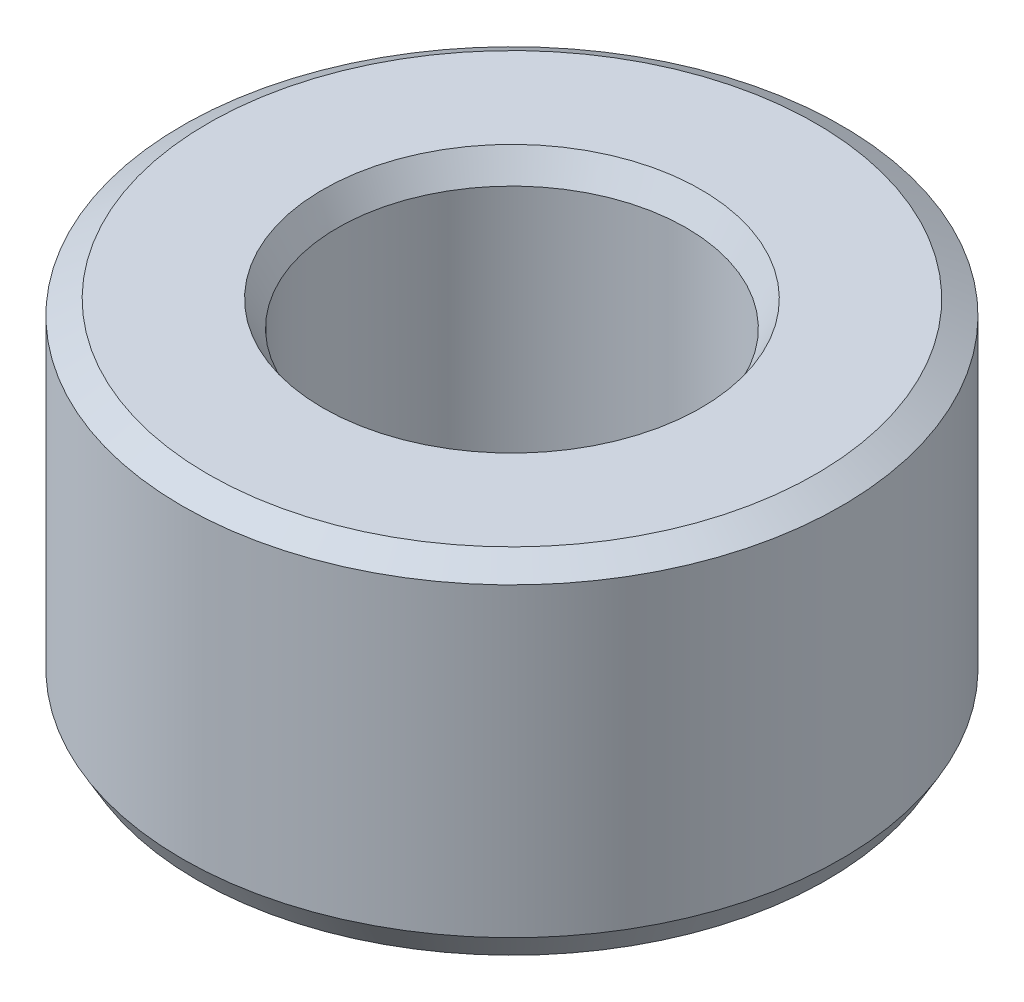
ISO-10303-21;
HEADER;
FILE_DESCRIPTION(('STEP AP214'),'2;1');
FILE_NAME('part.step','',(''),(''),'','','');
FILE_SCHEMA(('AUTOMOTIVE_DESIGN { 1 0 10303 214 1 1 1 1 }'));
ENDSEC;
DATA;
#1=APPLICATION_CONTEXT('core data for automotive mechanical design processes');
#2=APPLICATION_PROTOCOL_DEFINITION('international standard','automotive_design',2000,#1);
#3=PRODUCT_CONTEXT('',#1,'mechanical');
#4=PRODUCT('Part','Part','',(#3));
#5=PRODUCT_RELATED_PRODUCT_CATEGORY('part','',(#4));
#6=PRODUCT_DEFINITION_FORMATION('','',#4);
#7=PRODUCT_DEFINITION_CONTEXT('part definition',#1,'design');
#8=PRODUCT_DEFINITION('design','',#6,#7);
#9=PRODUCT_DEFINITION_SHAPE('','',#8);
#10=(LENGTH_UNIT() NAMED_UNIT(*) SI_UNIT(.MILLI.,.METRE.));
#11=(NAMED_UNIT(*) PLANE_ANGLE_UNIT() SI_UNIT($,.RADIAN.));
#12=(NAMED_UNIT(*) SI_UNIT($,.STERADIAN.) SOLID_ANGLE_UNIT());
#13=UNCERTAINTY_MEASURE_WITH_UNIT(LENGTH_MEASURE(1.E-05),#10,'distance_accuracy_value','');
#14=(GEOMETRIC_REPRESENTATION_CONTEXT(3) GLOBAL_UNCERTAINTY_ASSIGNED_CONTEXT((#13)) GLOBAL_UNIT_ASSIGNED_CONTEXT((#10,
#11,#12)) REPRESENTATION_CONTEXT('',''));
#15=CARTESIAN_POINT('',(0.,0.,0.));
#16=DIRECTION('',(0.,0.,1.));
#17=DIRECTION('',(1.,0.,0.));
#18=AXIS2_PLACEMENT_3D('',#15,#16,#17);
#19=CARTESIAN_POINT('',(0.,44.6187558369004,0.));
#20=DIRECTION('',(0.,-1.,0.));
#21=DIRECTION('',(0.,0.,-1.));
#22=AXIS2_PLACEMENT_3D('',#19,#20,#21);
#23=CYLINDRICAL_SURFACE('',#22,42.5);
#24=CARTESIAN_POINT('',(0.,3.3073891955385,0.));
#25=DIRECTION('',(0.,1.,0.));
#26=DIRECTION('',(0.,0.,1.));
#27=AXIS2_PLACEMENT_3D('',#24,#25,#26);
#28=CIRCLE('',#27,42.5);
#29=CARTESIAN_POINT('',(0.,3.3073891955385,42.5));
#30=VERTEX_POINT('',#29);
#31=EDGE_CURVE('E10',#30,#30,#28,.T.);
#32=ORIENTED_EDGE('',*,*,#31,.T.);
#33=EDGE_LOOP('',(#32));
#34=FACE_BOUND('',#33,.T.);
#35=CARTESIAN_POINT('',(0.,42.7092337945414,0.));
#36=DIRECTION('',(0.,1.,0.));
#37=DIRECTION('',(0.,0.,1.));
#38=AXIS2_PLACEMENT_3D('',#35,#36,#37);
#39=CIRCLE('',#38,42.5);
#40=CARTESIAN_POINT('',(0.,42.7092337945414,42.5));
#41=VERTEX_POINT('',#40);
#42=EDGE_CURVE('E50',#41,#41,#39,.F.);
#43=ORIENTED_EDGE('',*,*,#42,.T.);
#44=EDGE_LOOP('',(#43));
#45=FACE_BOUND('',#44,.T.);
#46=ADVANCED_FACE('F39',(#34,#45),#23,.T.);
#47=CARTESIAN_POINT('',(0.,44.6187558369004,0.));
#48=DIRECTION('',(0.,1.,0.));
#49=DIRECTION('',(0.,0.,1.));
#50=AXIS2_PLACEMENT_3D('',#47,#48,#49);
#51=PLANE('',#50);
#52=CARTESIAN_POINT('',(0.,44.6187558369004,0.));
#53=DIRECTION('',(0.,1.,0.));
#54=DIRECTION('',(0.,0.,1.));
#55=AXIS2_PLACEMENT_3D('',#52,#53,#54);
#56=CIRCLE('',#55,24.3830783270782);
#57=CARTESIAN_POINT('',(0.,44.6187558369004,24.3830783270782));
#58=VERTEX_POINT('',#57);
#59=EDGE_CURVE('E58',#58,#58,#56,.F.);
#60=ORIENTED_EDGE('',*,*,#59,.T.);
#61=EDGE_LOOP('',(#60));
#62=FACE_BOUND('',#61,.T.);
#63=CARTESIAN_POINT('',(0.,44.6187558369004,0.));
#64=DIRECTION('',(0.,1.,0.));
#65=DIRECTION('',(0.,0.,1.));
#66=AXIS2_PLACEMENT_3D('',#63,#64,#65);
#67=CIRCLE('',#66,39.1926108044615);
#68=CARTESIAN_POINT('',(0.,44.6187558369004,39.1926108044615));
#69=VERTEX_POINT('',#68);
#70=EDGE_CURVE('E61',#69,#69,#67,.T.);
#71=ORIENTED_EDGE('',*,*,#70,.T.);
#72=EDGE_LOOP('',(#71));
#73=FACE_BOUND('',#72,.T.);
#74=ADVANCED_FACE('F88',(#62,#73),#51,.T.);
#75=CARTESIAN_POINT('',(0.,0.,0.));
#76=DIRECTION('',(0.,1.,0.));
#77=DIRECTION('',(0.,0.,1.));
#78=AXIS2_PLACEMENT_3D('',#75,#76,#77);
#79=PLANE('',#78);
#80=CARTESIAN_POINT('',(0.,0.,0.));
#81=DIRECTION('',(0.,1.,0.));
#82=DIRECTION('',(0.,0.,1.));
#83=AXIS2_PLACEMENT_3D('',#80,#81,#82);
#84=CIRCLE('',#83,25.7809454802577);
#85=CARTESIAN_POINT('',(0.,0.,25.7809454802577));
#86=VERTEX_POINT('',#85);
#87=EDGE_CURVE('E51',#86,#86,#84,.T.);
#88=ORIENTED_EDGE('',*,*,#87,.T.);
#89=EDGE_LOOP('',(#88));
#90=FACE_BOUND('',#89,.T.);
#91=CARTESIAN_POINT('',(0.,0.,0.));
#92=DIRECTION('',(0.,1.,0.));
#93=DIRECTION('',(0.,0.,1.));
#94=AXIS2_PLACEMENT_3D('',#91,#92,#93);
#95=CIRCLE('',#94,40.590477957641);
#96=CARTESIAN_POINT('',(0.,0.,40.590477957641));
#97=VERTEX_POINT('',#96);
#98=EDGE_CURVE('E54',#97,#97,#95,.F.);
#99=ORIENTED_EDGE('',*,*,#98,.T.);
#100=EDGE_LOOP('',(#99));
#101=FACE_BOUND('',#100,.T.);
#102=ADVANCED_FACE('F83',(#90,#101),#79,.F.);
#103=CARTESIAN_POINT('',(0.,44.6187558369004,0.));
#104=DIRECTION('',(0.,-1.,0.));
#105=DIRECTION('',(0.,0.,-1.));
#106=AXIS2_PLACEMENT_3D('',#103,#104,#105);
#107=CYLINDRICAL_SURFACE('',#106,22.4735562847192);
#108=CARTESIAN_POINT('',(0.,41.3113666413619,0.));
#109=DIRECTION('',(0.,1.,0.));
#110=DIRECTION('',(0.,0.,1.));
#111=AXIS2_PLACEMENT_3D('',#108,#109,#110);
#112=CIRCLE('',#111,22.4735562847192);
#113=CARTESIAN_POINT('',(0.,41.3113666413619,22.4735562847192));
#114=VERTEX_POINT('',#113);
#115=EDGE_CURVE('E67',#114,#114,#112,.T.);
#116=ORIENTED_EDGE('',*,*,#115,.T.);
#117=EDGE_LOOP('',(#116));
#118=FACE_BOUND('',#117,.T.);
#119=CARTESIAN_POINT('',(0.,1.90952204235904,0.));
#120=DIRECTION('',(0.,1.,0.));
#121=DIRECTION('',(0.,0.,1.));
#122=AXIS2_PLACEMENT_3D('',#119,#120,#121);
#123=CIRCLE('',#122,22.4735562847192);
#124=CARTESIAN_POINT('',(0.,1.90952204235904,22.4735562847192));
#125=VERTEX_POINT('',#124);
#126=EDGE_CURVE('E69',#125,#125,#123,.F.);
#127=ORIENTED_EDGE('',*,*,#126,.T.);
#128=EDGE_LOOP('',(#127));
#129=FACE_BOUND('',#128,.T.);
#130=ADVANCED_FACE('F71',(#118,#129),#107,.F.);
#131=CARTESIAN_POINT('',(0.,41.3113666413619,0.));
#132=DIRECTION('',(0.,1.,0.));
#133=DIRECTION('',(0.,0.,1.));
#134=AXIS2_PLACEMENT_3D('',#131,#132,#133);
#135=CONICAL_SURFACE('',#134,22.4735562847192,0.523598775598301);
#136=ORIENTED_EDGE('',*,*,#59,.F.);
#137=EDGE_LOOP('',(#136));
#138=FACE_BOUND('',#137,.T.);
#139=ORIENTED_EDGE('',*,*,#115,.F.);
#140=EDGE_LOOP('',(#139));
#141=FACE_BOUND('',#140,.T.);
#142=ADVANCED_FACE('F77',(#138,#141),#135,.F.);
#143=CARTESIAN_POINT('',(0.,0.,0.));
#144=DIRECTION('',(0.,-1.,0.));
#145=DIRECTION('',(0.,0.,-1.));
#146=AXIS2_PLACEMENT_3D('',#143,#144,#145);
#147=CONICAL_SURFACE('',#146,25.7809454802577,1.04719755119659);
#148=ORIENTED_EDGE('',*,*,#126,.F.);
#149=EDGE_LOOP('',(#148));
#150=FACE_BOUND('',#149,.T.);
#151=ORIENTED_EDGE('',*,*,#87,.F.);
#152=EDGE_LOOP('',(#151));
#153=FACE_BOUND('',#152,.T.);
#154=ADVANCED_FACE('F73',(#150,#153),#147,.F.);
#155=CARTESIAN_POINT('',(0.,3.3073891955385,0.));
#156=DIRECTION('',(0.,1.,0.));
#157=DIRECTION('',(0.,0.,1.));
#158=AXIS2_PLACEMENT_3D('',#155,#156,#157);
#159=CONICAL_SURFACE('',#158,42.5,0.523598775598302);
#160=CARTESIAN_POINT('',(0.,0.,40.590477957641));
#161=CARTESIAN_POINT('',(0.,0.0344519707868597,40.6103688122489));
#162=CARTESIAN_POINT('',(0.,0.0689039415737186,40.6302596668568));
#163=CARTESIAN_POINT('',(0.,0.137807883147437,40.6700413760726));
#164=CARTESIAN_POINT('',(0.,0.172259853934296,40.6899322306805));
#165=CARTESIAN_POINT('',(0.,0.241163795508015,40.7297139398963));
#166=CARTESIAN_POINT('',(0.,0.275615766294875,40.7496047945042));
#167=CARTESIAN_POINT('',(0.,0.344519707868593,40.78938650372));
#168=CARTESIAN_POINT('',(0.,0.378971678655452,40.809277358328));
#169=CARTESIAN_POINT('',(0.,0.447875620229171,40.8490590675438));
#170=CARTESIAN_POINT('',(0.,0.48232759101603,40.8689499221517));
#171=CARTESIAN_POINT('',(0.,0.551231532589749,40.9087316313675));
#172=CARTESIAN_POINT('',(0.,0.585683503376608,40.9286224859754));
#173=CARTESIAN_POINT('',(0.,0.654587444950327,40.9684041951912));
#174=CARTESIAN_POINT('',(0.,0.689039415737186,40.9882950497991));
#175=CARTESIAN_POINT('',(0.,0.757943357310905,41.0280767590149));
#176=CARTESIAN_POINT('',(0.,0.792395328097764,41.0479676136228));
#177=CARTESIAN_POINT('',(0.,0.861299269671483,41.0877493228387));
#178=CARTESIAN_POINT('',(0.,0.895751240458342,41.1076401774466));
#179=CARTESIAN_POINT('',(0.,0.964655182032061,41.1474218866624));
#180=CARTESIAN_POINT('',(0.,0.999107152818921,41.1673127412703));
#181=CARTESIAN_POINT('',(0.,1.06801109439264,41.2070944504861));
#182=CARTESIAN_POINT('',(0.,1.1024630651795,41.226985305094));
#183=CARTESIAN_POINT('',(0.,1.17136700675322,41.2667670143098));
#184=CARTESIAN_POINT('',(0.,1.20581897754008,41.2866578689177));
#185=CARTESIAN_POINT('',(0.,1.27472291911379,41.3264395781335));
#186=CARTESIAN_POINT('',(0.,1.30917488990065,41.3463304327414));
#187=CARTESIAN_POINT('',(0.,1.37807883147437,41.3861121419572));
#188=CARTESIAN_POINT('',(0.,1.41253080226123,41.4060029965652));
#189=CARTESIAN_POINT('',(0.,1.48143474383495,41.445784705781));
#190=CARTESIAN_POINT('',(0.,1.51588671462181,41.4656755603889));
#191=CARTESIAN_POINT('',(0.,1.58479065619553,41.5054572696047));
#192=CARTESIAN_POINT('',(0.,1.61924262698239,41.5253481242126));
#193=CARTESIAN_POINT('',(0.,1.68814656855611,41.5651298334284));
#194=CARTESIAN_POINT('',(0.,1.72259853934297,41.5850206880363));
#195=CARTESIAN_POINT('',(0.,1.79150248091668,41.6248023972521));
#196=CARTESIAN_POINT('',(0.,1.82595445170354,41.64469325186));
#197=CARTESIAN_POINT('',(0.,1.89485839327726,41.6844749610758));
#198=CARTESIAN_POINT('',(0.,1.92931036406412,41.7043658156838));
#199=CARTESIAN_POINT('',(0.,1.99821430563784,41.7441475248996));
#200=CARTESIAN_POINT('',(0.,2.0326662764247,41.7640383795075));
#201=CARTESIAN_POINT('',(0.,2.10157021799842,41.8038200887233));
#202=CARTESIAN_POINT('',(0.,2.13602218878528,41.8237109433312));
#203=CARTESIAN_POINT('',(0.,2.204926130359,41.863492652547));
#204=CARTESIAN_POINT('',(0.,2.23937810114586,41.8833835071549));
#205=CARTESIAN_POINT('',(0.,2.30828204271957,41.9231652163707));
#206=CARTESIAN_POINT('',(0.,2.34273401350643,41.9430560709786));
#207=CARTESIAN_POINT('',(0.,2.41163795508015,41.9828377801944));
#208=CARTESIAN_POINT('',(0.,2.44608992586701,42.0027286348023));
#209=CARTESIAN_POINT('',(0.,2.51499386744073,42.0425103440182));
#210=CARTESIAN_POINT('',(0.,2.54944583822759,42.0624011986261));
#211=CARTESIAN_POINT('',(0.,2.61834977980131,42.1021829078419));
#212=CARTESIAN_POINT('',(0.,2.65280175058817,42.1220737624498));
#213=CARTESIAN_POINT('',(0.,2.72170569216189,42.1618554716656));
#214=CARTESIAN_POINT('',(0.,2.75615766294875,42.1817463262735));
#215=CARTESIAN_POINT('',(0.,2.82506160452246,42.2215280354893));
#216=CARTESIAN_POINT('',(0.,2.85951357530932,42.2414188900972));
#217=CARTESIAN_POINT('',(0.,2.92841751688304,42.281200599313));
#218=CARTESIAN_POINT('',(0.,2.9628694876699,42.3010914539209));
#219=CARTESIAN_POINT('',(0.,3.03177342924362,42.3408731631368));
#220=CARTESIAN_POINT('',(0.,3.06622540003048,42.3607640177447));
#221=CARTESIAN_POINT('',(0.,3.1351293416042,42.4005457269605));
#222=CARTESIAN_POINT('',(0.,3.16958131239106,42.4204365815684));
#223=CARTESIAN_POINT('',(0.,3.23848525396478,42.4602182907842));
#224=CARTESIAN_POINT('',(0.,3.27293722475164,42.4801091453921));
#225=CARTESIAN_POINT('',(0.,3.3073891955385,42.5));
#226=B_SPLINE_CURVE_WITH_KNOTS('',3,(#160,#161,#162,#163,#164,#165,#166,#167,#168,#169,#170,
#171,#172,#173,#174,#175,#176,#177,#178,#179,#180,#181,#182,#183,#184,#185,#186,#187,#188,#189,
#190,#191,#192,#193,#194,#195,#196,#197,#198,#199,#200,#201,#202,#203,#204,#205,#206,#207,#208,
#209,#210,#211,#212,#213,#214,#215,#216,#217,#218,#219,#220,#221,#222,#223,#224,#225),
.UNSPECIFIED.,.F.,.F.,(4,2,2,2,2,2,2,2,2,2,2,2,2,2,2,2,2,2,2,2,2,2,2,2,2,2,2,2,2,2,2,2,4),(0.,
0.119345127647439,0.238690255294878,0.358035382942313,0.477380510589752,0.596725638237191,
0.71607076588463,0.835415893532069,0.954761021179508,1.07410614882695,1.19345127647438,
1.31279640412182,1.43214153176926,1.5514866594167,1.67083178706414,1.79017691471158,
1.90952204235901,2.02886717000645,2.14821229765389,2.26755742530133,2.38690255294877,
2.50624768059621,2.62559280824365,2.74493793589108,2.86428306353852,2.98362819118596,
3.1029733188334,3.22231844648084,3.34166357412828,3.46100870177571,3.58035382942315,
3.69969895707059,3.81904408471803),.UNSPECIFIED.);
#227=EDGE_CURVE('BSEAM76',#97,#30,#226,.T.);
#228=ORIENTED_EDGE('',*,*,#98,.F.);
#229=ORIENTED_EDGE('',*,*,#31,.F.);
#230=ORIENTED_EDGE('',*,*,#227,.T.);
#231=ORIENTED_EDGE('',*,*,#227,.F.);
#232=EDGE_LOOP('',(#228,#230,#229,#231));
#233=FACE_BOUND('',#232,.T.);
#234=ADVANCED_FACE('F76',(#233),#159,.T.);
#235=CARTESIAN_POINT('',(0.,44.6187558369004,0.));
#236=DIRECTION('',(0.,-1.,0.));
#237=DIRECTION('',(0.,0.,-1.));
#238=AXIS2_PLACEMENT_3D('',#235,#236,#237);
#239=CONICAL_SURFACE('',#238,39.1926108044615,1.04719755119659);
#240=ORIENTED_EDGE('',*,*,#42,.F.);
#241=EDGE_LOOP('',(#240));
#242=FACE_BOUND('',#241,.T.);
#243=ORIENTED_EDGE('',*,*,#70,.F.);
#244=EDGE_LOOP('',(#243));
#245=FACE_BOUND('',#244,.T.);
#246=ADVANCED_FACE('F45',(#242,#245),#239,.T.);
#247=CLOSED_SHELL('',(#46,#74,#102,#130,#142,#154,#234,#246));
#248=MANIFOLD_SOLID_BREP('B2',#247);
#249=ADVANCED_BREP_SHAPE_REPRESENTATION('',(#18,#248),#14);
#250=SHAPE_DEFINITION_REPRESENTATION(#9,#249);
ENDSEC;
END-ISO-10303-21;
